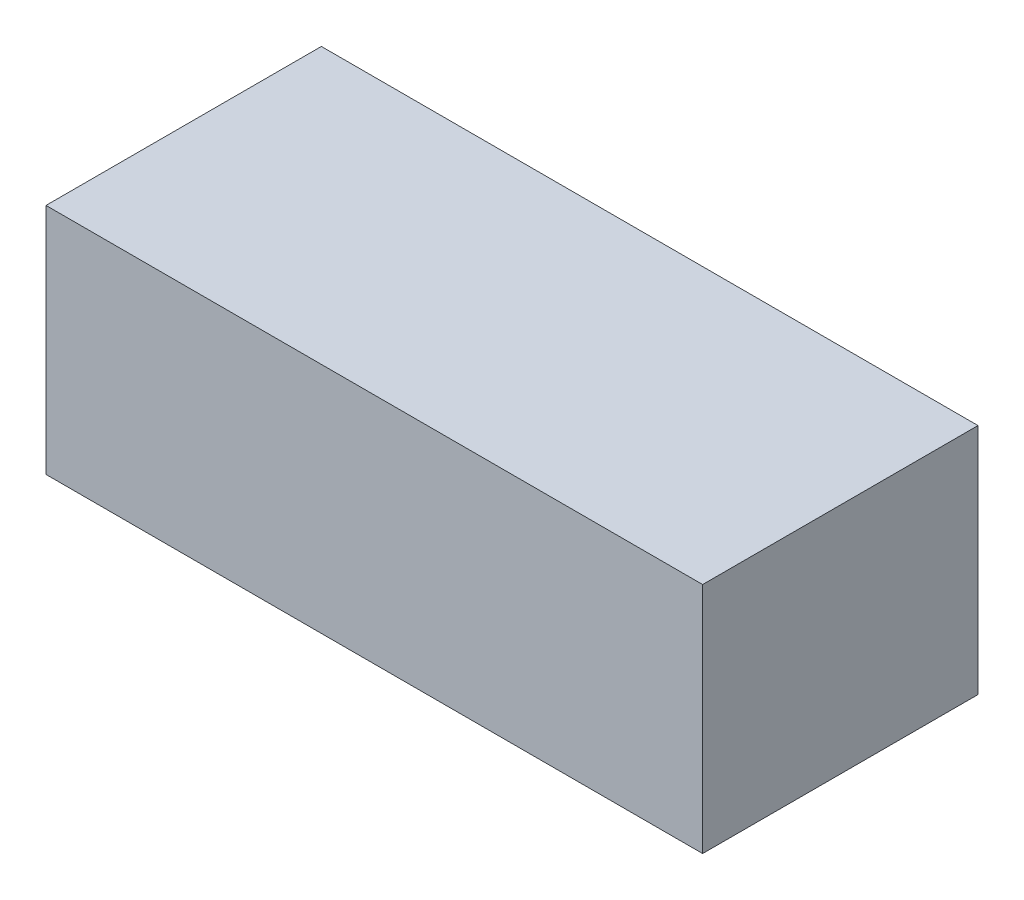
ISO-10303-21;
HEADER;
FILE_DESCRIPTION(('STEP AP214'),'2;1');
FILE_NAME('part.step','',(''),(''),'','','');
FILE_SCHEMA(('AUTOMOTIVE_DESIGN { 1 0 10303 214 1 1 1 1 }'));
ENDSEC;
DATA;
#1=APPLICATION_CONTEXT('core data for automotive mechanical design processes');
#2=APPLICATION_PROTOCOL_DEFINITION('international standard','automotive_design',2000,#1);
#3=PRODUCT_CONTEXT('',#1,'mechanical');
#4=PRODUCT('Part','Part','',(#3));
#5=PRODUCT_RELATED_PRODUCT_CATEGORY('part','',(#4));
#6=PRODUCT_DEFINITION_FORMATION('','',#4);
#7=PRODUCT_DEFINITION_CONTEXT('part definition',#1,'design');
#8=PRODUCT_DEFINITION('design','',#6,#7);
#9=PRODUCT_DEFINITION_SHAPE('','',#8);
#10=(LENGTH_UNIT() NAMED_UNIT(*) SI_UNIT(.MILLI.,.METRE.));
#11=(NAMED_UNIT(*) PLANE_ANGLE_UNIT() SI_UNIT($,.RADIAN.));
#12=(NAMED_UNIT(*) SI_UNIT($,.STERADIAN.) SOLID_ANGLE_UNIT());
#13=UNCERTAINTY_MEASURE_WITH_UNIT(LENGTH_MEASURE(1.E-05),#10,'distance_accuracy_value','');
#14=(GEOMETRIC_REPRESENTATION_CONTEXT(3) GLOBAL_UNCERTAINTY_ASSIGNED_CONTEXT((#13)) GLOBAL_UNIT_ASSIGNED_CONTEXT((#10,
#11,#12)) REPRESENTATION_CONTEXT('',''));
#15=CARTESIAN_POINT('',(0.,0.,0.));
#16=DIRECTION('',(0.,0.,1.));
#17=DIRECTION('',(1.,0.,0.));
#18=AXIS2_PLACEMENT_3D('',#15,#16,#17);
#19=CARTESIAN_POINT('',(-15.6313559322034,11.,-13.4639830508475));
#20=DIRECTION('',(1.,0.,0.));
#21=DIRECTION('',(0.,0.,-1.));
#22=AXIS2_PLACEMENT_3D('',#19,#20,#21);
#23=PLANE('',#22);
#24=DIRECTION('',(0.,0.,1.));
#25=VECTOR('',#24,1.);
#26=CARTESIAN_POINT('',(-15.6313559322034,0.,-13.4639830508475));
#27=LINE('',#26,#25);
#28=CARTESIAN_POINT('',(-15.6313559322034,0.,-13.4639830508475));
#29=VERTEX_POINT('',#28);
#30=CARTESIAN_POINT('',(-15.6313559322034,0.,-0.463983050847459));
#31=VERTEX_POINT('',#30);
#32=EDGE_CURVE('E96',#29,#31,#27,.T.);
#33=ORIENTED_EDGE('',*,*,#32,.T.);
#34=DIRECTION('',(0.,-1.,0.));
#35=VECTOR('',#34,1.);
#36=CARTESIAN_POINT('',(-15.6313559322034,11.,-0.463983050847459));
#37=LINE('',#36,#35);
#38=CARTESIAN_POINT('',(-15.6313559322034,11.,-0.463983050847459));
#39=VERTEX_POINT('',#38);
#40=EDGE_CURVE('E11',#39,#31,#37,.T.);
#41=ORIENTED_EDGE('',*,*,#40,.F.);
#42=DIRECTION('',(0.,0.,1.));
#43=VECTOR('',#42,1.);
#44=CARTESIAN_POINT('',(-15.6313559322034,11.,-13.4639830508475));
#45=LINE('',#44,#43);
#46=CARTESIAN_POINT('',(-15.6313559322034,11.,-13.4639830508475));
#47=VERTEX_POINT('',#46);
#48=EDGE_CURVE('E84',#47,#39,#45,.T.);
#49=ORIENTED_EDGE('',*,*,#48,.F.);
#50=DIRECTION('',(0.,-1.,0.));
#51=VECTOR('',#50,1.);
#52=CARTESIAN_POINT('',(-15.6313559322034,11.,-13.4639830508475));
#53=LINE('',#52,#51);
#54=EDGE_CURVE('E92',#47,#29,#53,.T.);
#55=ORIENTED_EDGE('',*,*,#54,.T.);
#56=EDGE_LOOP('',(#33,#41,#49,#55));
#57=FACE_BOUND('',#56,.T.);
#58=ADVANCED_FACE('F33',(#57),#23,.F.);
#59=CARTESIAN_POINT('',(-15.6313559322034,11.,-0.463983050847459));
#60=DIRECTION('',(0.,0.,-1.));
#61=DIRECTION('',(-1.,0.,0.));
#62=AXIS2_PLACEMENT_3D('',#59,#60,#61);
#63=PLANE('',#62);
#64=DIRECTION('',(1.,0.,0.));
#65=VECTOR('',#64,1.);
#66=CARTESIAN_POINT('',(-15.6313559322034,0.,-0.463983050847459));
#67=LINE('',#66,#65);
#68=CARTESIAN_POINT('',(15.3686440677966,0.,-0.463983050847459));
#69=VERTEX_POINT('',#68);
#70=EDGE_CURVE('E88',#31,#69,#67,.T.);
#71=ORIENTED_EDGE('',*,*,#70,.T.);
#72=DIRECTION('',(0.,-1.,0.));
#73=VECTOR('',#72,1.);
#74=CARTESIAN_POINT('',(15.3686440677966,11.,-0.463983050847459));
#75=LINE('',#74,#73);
#76=CARTESIAN_POINT('',(15.3686440677966,11.,-0.463983050847459));
#77=VERTEX_POINT('',#76);
#78=EDGE_CURVE('E41',#77,#69,#75,.T.);
#79=ORIENTED_EDGE('',*,*,#78,.F.);
#80=DIRECTION('',(1.,0.,0.));
#81=VECTOR('',#80,1.);
#82=CARTESIAN_POINT('',(-15.6313559322034,11.,-0.463983050847459));
#83=LINE('',#82,#81);
#84=EDGE_CURVE('E79',#39,#77,#83,.T.);
#85=ORIENTED_EDGE('',*,*,#84,.F.);
#86=ORIENTED_EDGE('',*,*,#40,.T.);
#87=EDGE_LOOP('',(#71,#79,#85,#86));
#88=FACE_BOUND('',#87,.T.);
#89=ADVANCED_FACE('F87',(#88),#63,.F.);
#90=CARTESIAN_POINT('',(15.3686440677966,11.,-13.4639830508475));
#91=DIRECTION('',(-1.,0.,0.));
#92=DIRECTION('',(0.,0.,1.));
#93=AXIS2_PLACEMENT_3D('',#90,#91,#92);
#94=PLANE('',#93);
#95=DIRECTION('',(0.,0.,-1.));
#96=VECTOR('',#95,1.);
#97=CARTESIAN_POINT('',(15.3686440677966,0.,-13.4639830508475));
#98=LINE('',#97,#96);
#99=CARTESIAN_POINT('',(15.3686440677966,0.,-13.4639830508475));
#100=VERTEX_POINT('',#99);
#101=EDGE_CURVE('E66',#69,#100,#98,.T.);
#102=ORIENTED_EDGE('',*,*,#101,.T.);
#103=DIRECTION('',(0.,-1.,0.));
#104=VECTOR('',#103,1.);
#105=CARTESIAN_POINT('',(15.3686440677966,11.,-13.4639830508475));
#106=LINE('',#105,#104);
#107=CARTESIAN_POINT('',(15.3686440677966,11.,-13.4639830508475));
#108=VERTEX_POINT('',#107);
#109=EDGE_CURVE('E89',#108,#100,#106,.T.);
#110=ORIENTED_EDGE('',*,*,#109,.F.);
#111=DIRECTION('',(0.,0.,-1.));
#112=VECTOR('',#111,1.);
#113=CARTESIAN_POINT('',(15.3686440677966,11.,-13.4639830508475));
#114=LINE('',#113,#112);
#115=EDGE_CURVE('E82',#77,#108,#114,.T.);
#116=ORIENTED_EDGE('',*,*,#115,.F.);
#117=ORIENTED_EDGE('',*,*,#78,.T.);
#118=EDGE_LOOP('',(#102,#110,#116,#117));
#119=FACE_BOUND('',#118,.T.);
#120=ADVANCED_FACE('F90',(#119),#94,.F.);
#121=CARTESIAN_POINT('',(-15.6313559322034,11.,-13.4639830508475));
#122=DIRECTION('',(0.,0.,1.));
#123=DIRECTION('',(1.,0.,0.));
#124=AXIS2_PLACEMENT_3D('',#121,#122,#123);
#125=PLANE('',#124);
#126=DIRECTION('',(-1.,0.,0.));
#127=VECTOR('',#126,1.);
#128=CARTESIAN_POINT('',(-15.6313559322034,0.,-13.4639830508475));
#129=LINE('',#128,#127);
#130=EDGE_CURVE('E72',#100,#29,#129,.T.);
#131=ORIENTED_EDGE('',*,*,#130,.T.);
#132=ORIENTED_EDGE('',*,*,#54,.F.);
#133=DIRECTION('',(-1.,0.,0.));
#134=VECTOR('',#133,1.);
#135=CARTESIAN_POINT('',(-15.6313559322034,11.,-13.4639830508475));
#136=LINE('',#135,#134);
#137=EDGE_CURVE('E49',#108,#47,#136,.T.);
#138=ORIENTED_EDGE('',*,*,#137,.F.);
#139=ORIENTED_EDGE('',*,*,#109,.T.);
#140=EDGE_LOOP('',(#131,#132,#138,#139));
#141=FACE_BOUND('',#140,.T.);
#142=ADVANCED_FACE('F103',(#141),#125,.F.);
#143=CARTESIAN_POINT('',(0.,11.,0.));
#144=DIRECTION('',(0.,1.,0.));
#145=DIRECTION('',(0.,0.,1.));
#146=AXIS2_PLACEMENT_3D('',#143,#144,#145);
#147=PLANE('',#146);
#148=ORIENTED_EDGE('',*,*,#48,.T.);
#149=ORIENTED_EDGE('',*,*,#84,.T.);
#150=ORIENTED_EDGE('',*,*,#115,.T.);
#151=ORIENTED_EDGE('',*,*,#137,.T.);
#152=EDGE_LOOP('',(#148,#149,#150,#151));
#153=FACE_BOUND('',#152,.T.);
#154=ADVANCED_FACE('F80',(#153),#147,.T.);
#155=CARTESIAN_POINT('',(0.,0.,0.));
#156=DIRECTION('',(0.,1.,0.));
#157=DIRECTION('',(0.,0.,1.));
#158=AXIS2_PLACEMENT_3D('',#155,#156,#157);
#159=PLANE('',#158);
#160=ORIENTED_EDGE('',*,*,#32,.F.);
#161=ORIENTED_EDGE('',*,*,#130,.F.);
#162=ORIENTED_EDGE('',*,*,#101,.F.);
#163=ORIENTED_EDGE('',*,*,#70,.F.);
#164=EDGE_LOOP('',(#160,#161,#162,#163));
#165=FACE_BOUND('',#164,.T.);
#166=ADVANCED_FACE('F106',(#165),#159,.F.);
#167=CLOSED_SHELL('',(#58,#89,#120,#142,#154,#166));
#168=MANIFOLD_SOLID_BREP('B2',#167);
#169=ADVANCED_BREP_SHAPE_REPRESENTATION('',(#18,#168),#14);
#170=SHAPE_DEFINITION_REPRESENTATION(#9,#169);
ENDSEC;
END-ISO-10303-21;
